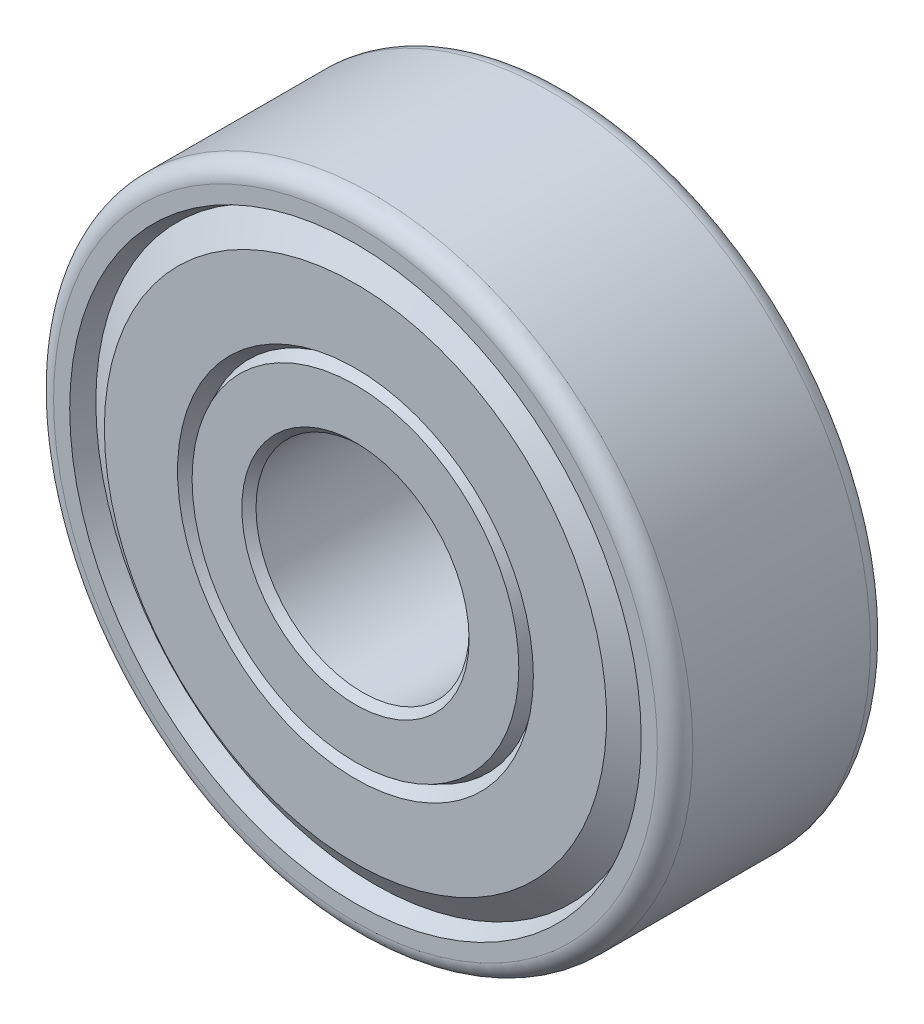
ISO-10303-21;
HEADER;
FILE_DESCRIPTION(('STEP AP214'),'2;1');
FILE_NAME('part.step','',(''),(''),'','','');
FILE_SCHEMA(('AUTOMOTIVE_DESIGN { 1 0 10303 214 1 1 1 1 }'));
ENDSEC;
DATA;
#1=APPLICATION_CONTEXT('core data for automotive mechanical design processes');
#2=APPLICATION_PROTOCOL_DEFINITION('international standard','automotive_design',2000,#1);
#3=PRODUCT_CONTEXT('',#1,'mechanical');
#4=PRODUCT('Part','Part','',(#3));
#5=PRODUCT_RELATED_PRODUCT_CATEGORY('part','',(#4));
#6=PRODUCT_DEFINITION_FORMATION('','',#4);
#7=PRODUCT_DEFINITION_CONTEXT('part definition',#1,'design');
#8=PRODUCT_DEFINITION('design','',#6,#7);
#9=PRODUCT_DEFINITION_SHAPE('','',#8);
#10=(LENGTH_UNIT() NAMED_UNIT(*) SI_UNIT(.MILLI.,.METRE.));
#11=(NAMED_UNIT(*) PLANE_ANGLE_UNIT() SI_UNIT($,.RADIAN.));
#12=(NAMED_UNIT(*) SI_UNIT($,.STERADIAN.) SOLID_ANGLE_UNIT());
#13=UNCERTAINTY_MEASURE_WITH_UNIT(LENGTH_MEASURE(1.E-05),#10,'distance_accuracy_value','');
#14=(GEOMETRIC_REPRESENTATION_CONTEXT(3) GLOBAL_UNCERTAINTY_ASSIGNED_CONTEXT((#13)) GLOBAL_UNIT_ASSIGNED_CONTEXT((#10,
#11,#12)) REPRESENTATION_CONTEXT('',''));
#15=CARTESIAN_POINT('',(0.,0.,0.));
#16=DIRECTION('',(0.,0.,1.));
#17=DIRECTION('',(1.,0.,0.));
#18=AXIS2_PLACEMENT_3D('',#15,#16,#17);
#19=CARTESIAN_POINT('',(0.,0.,0.));
#20=DIRECTION('',(0.,0.,1.));
#21=DIRECTION('',(1.,0.,0.));
#22=AXIS2_PLACEMENT_3D('',#19,#20,#21);
#23=CYLINDRICAL_SURFACE('',#22,4.7625);
#24=CARTESIAN_POINT('',(0.,0.,-4.44499999986192));
#25=DIRECTION('',(0.,0.,-1.));
#26=DIRECTION('',(-1.,0.,0.));
#27=AXIS2_PLACEMENT_3D('',#24,#25,#26);
#28=CIRCLE('',#27,4.76250000008349);
#29=CARTESIAN_POINT('',(-4.76250000008349,0.,-4.44499999986192));
#30=VERTEX_POINT('',#29);
#31=EDGE_CURVE('E315',#30,#30,#28,.T.);
#32=ORIENTED_EDGE('',*,*,#31,.T.);
#33=EDGE_LOOP('',(#32));
#34=FACE_BOUND('',#33,.T.);
#35=CARTESIAN_POINT('',(0.,0.,4.44499999986192));
#36=DIRECTION('',(0.,0.,1.));
#37=DIRECTION('',(-1.,0.,0.));
#38=AXIS2_PLACEMENT_3D('',#35,#36,#37);
#39=CIRCLE('',#38,4.76250000008349);
#40=CARTESIAN_POINT('',(-4.76250000008349,0.,4.44499999986192));
#41=VERTEX_POINT('',#40);
#42=EDGE_CURVE('E318',#41,#41,#39,.T.);
#43=ORIENTED_EDGE('',*,*,#42,.T.);
#44=EDGE_LOOP('',(#43));
#45=FACE_BOUND('',#44,.T.);
#46=ADVANCED_FACE('F17',(#34,#45),#23,.F.);
#47=CARTESIAN_POINT('',(0.,0.,-4.7624999999698));
#48=DIRECTION('',(0.,0.,-1.));
#49=DIRECTION('',(-1.,0.,0.));
#50=AXIS2_PLACEMENT_3D('',#47,#48,#49);
#51=CONICAL_SURFACE('',#50,5.07999999962294,0.785398162502276);
#52=CARTESIAN_POINT('',(0.,0.,-4.76250000008349));
#53=DIRECTION('',(0.,0.,-1.));
#54=DIRECTION('',(-1.,0.,0.));
#55=AXIS2_PLACEMENT_3D('',#52,#53,#54);
#56=CIRCLE('',#55,5.07999999973663);
#57=CARTESIAN_POINT('',(-5.07999999973663,0.,-4.76250000008349));
#58=VERTEX_POINT('',#57);
#59=EDGE_CURVE('E319',#58,#58,#56,.F.);
#60=ORIENTED_EDGE('',*,*,#59,.F.);
#61=EDGE_LOOP('',(#60));
#62=FACE_BOUND('',#61,.T.);
#63=ORIENTED_EDGE('',*,*,#31,.F.);
#64=EDGE_LOOP('',(#63));
#65=FACE_BOUND('',#64,.T.);
#66=ADVANCED_FACE('F249',(#62,#65),#51,.F.);
#67=CARTESIAN_POINT('',(0.,0.,4.7624999999698));
#68=DIRECTION('',(0.,0.,1.));
#69=DIRECTION('',(1.,0.,0.));
#70=AXIS2_PLACEMENT_3D('',#67,#68,#69);
#71=CONICAL_SURFACE('',#70,5.07999999962294,0.785398162502276);
#72=ORIENTED_EDGE('',*,*,#42,.F.);
#73=EDGE_LOOP('',(#72));
#74=FACE_BOUND('',#73,.T.);
#75=CARTESIAN_POINT('',(0.,0.,4.76250000008349));
#76=DIRECTION('',(0.,0.,1.));
#77=DIRECTION('',(1.,0.,0.));
#78=AXIS2_PLACEMENT_3D('',#75,#76,#77);
#79=CIRCLE('',#78,5.07999999973663);
#80=CARTESIAN_POINT('',(5.07999999973663,0.,4.76250000008349));
#81=VERTEX_POINT('',#80);
#82=EDGE_CURVE('E322',#81,#81,#79,.T.);
#83=ORIENTED_EDGE('',*,*,#82,.T.);
#84=EDGE_LOOP('',(#83));
#85=FACE_BOUND('',#84,.T.);
#86=ADVANCED_FACE('F241',(#74,#85),#71,.F.);
#87=CARTESIAN_POINT('',(0.,0.,-4.7625));
#88=DIRECTION('',(0.,0.,-1.));
#89=DIRECTION('',(-1.,0.,0.));
#90=AXIS2_PLACEMENT_3D('',#87,#88,#89);
#91=PLANE('',#90);
#92=ORIENTED_EDGE('',*,*,#59,.T.);
#93=EDGE_LOOP('',(#92));
#94=FACE_BOUND('',#93,.T.);
#95=CARTESIAN_POINT('',(0.,0.,-4.7625));
#96=DIRECTION('',(0.,0.,1.));
#97=DIRECTION('',(1.,0.,0.));
#98=AXIS2_PLACEMENT_3D('',#95,#96,#97);
#99=CIRCLE('',#98,7.3025);
#100=CARTESIAN_POINT('',(7.3025,0.,-4.7625));
#101=VERTEX_POINT('',#100);
#102=EDGE_CURVE('E352',#101,#101,#99,.T.);
#103=ORIENTED_EDGE('',*,*,#102,.F.);
#104=EDGE_LOOP('',(#103));
#105=FACE_BOUND('',#104,.T.);
#106=ADVANCED_FACE('F233',(#94,#105),#91,.T.);
#107=CARTESIAN_POINT('',(0.,0.,4.7625));
#108=DIRECTION('',(0.,0.,-1.));
#109=DIRECTION('',(-1.,0.,0.));
#110=AXIS2_PLACEMENT_3D('',#107,#108,#109);
#111=PLANE('',#110);
#112=ORIENTED_EDGE('',*,*,#82,.F.);
#113=EDGE_LOOP('',(#112));
#114=FACE_BOUND('',#113,.T.);
#115=CARTESIAN_POINT('',(0.,0.,4.76250000005854));
#116=DIRECTION('',(0.,0.,-1.));
#117=DIRECTION('',(-1.,0.,0.));
#118=AXIS2_PLACEMENT_3D('',#115,#116,#117);
#119=CIRCLE('',#118,7.30250000013546);
#120=CARTESIAN_POINT('',(-7.30250000013546,0.,4.76250000005854));
#121=VERTEX_POINT('',#120);
#122=EDGE_CURVE('E349',#121,#121,#119,.T.);
#123=ORIENTED_EDGE('',*,*,#122,.F.);
#124=EDGE_LOOP('',(#123));
#125=FACE_BOUND('',#124,.T.);
#126=ADVANCED_FACE('F225',(#114,#125),#111,.F.);
#127=CARTESIAN_POINT('',(0.,0.,-4.18132890087755));
#128=DIRECTION('',(0.,0.,1.));
#129=DIRECTION('',(1.,0.,0.));
#130=AXIS2_PLACEMENT_3D('',#127,#128,#129);
#131=CONICAL_SURFACE('',#130,7.55365742462336,0.407917424824535);
#132=CARTESIAN_POINT('',(0.,0.,-4.18132890087755));
#133=DIRECTION('',(0.,0.,-1.));
#134=DIRECTION('',(-1.,0.,0.));
#135=AXIS2_PLACEMENT_3D('',#132,#133,#134);
#136=CIRCLE('',#135,7.55365742462337);
#137=CARTESIAN_POINT('',(-7.55365742462337,0.,-4.18132890087755));
#138=VERTEX_POINT('',#137);
#139=EDGE_CURVE('E326',#138,#138,#136,.T.);
#140=ORIENTED_EDGE('',*,*,#139,.T.);
#141=EDGE_LOOP('',(#140));
#142=FACE_BOUND('',#141,.T.);
#143=ORIENTED_EDGE('',*,*,#102,.T.);
#144=EDGE_LOOP('',(#143));
#145=FACE_BOUND('',#144,.T.);
#146=ADVANCED_FACE('F217',(#142,#145),#131,.T.);
#147=CARTESIAN_POINT('',(0.,0.,4.18132890087755));
#148=DIRECTION('',(0.,0.,-1.));
#149=DIRECTION('',(-1.,0.,0.));
#150=AXIS2_PLACEMENT_3D('',#147,#148,#149);
#151=CONICAL_SURFACE('',#150,7.55365742446263,0.407917424358415);
#152=CARTESIAN_POINT('',(0.,0.,4.18132890066575));
#153=DIRECTION('',(0.,0.,1.));
#154=DIRECTION('',(-1.,0.,0.));
#155=AXIS2_PLACEMENT_3D('',#152,#153,#154);
#156=CIRCLE('',#155,7.55365742477154);
#157=CARTESIAN_POINT('',(-7.55365742477154,0.,4.18132890066575));
#158=VERTEX_POINT('',#157);
#159=EDGE_CURVE('E348',#158,#158,#156,.T.);
#160=ORIENTED_EDGE('',*,*,#159,.T.);
#161=EDGE_LOOP('',(#160));
#162=FACE_BOUND('',#161,.T.);
#163=ORIENTED_EDGE('',*,*,#122,.T.);
#164=EDGE_LOOP('',(#163));
#165=FACE_BOUND('',#164,.T.);
#166=ADVANCED_FACE('F209',(#162,#165),#151,.T.);
#167=CARTESIAN_POINT('',(0.,0.,-4.7625));
#168=DIRECTION('',(0.,0.,-1.));
#169=DIRECTION('',(-1.,0.,0.));
#170=AXIS2_PLACEMENT_3D('',#167,#168,#169);
#171=CONICAL_SURFACE('',#170,7.952136972928,0.601029540804804);
#172=ORIENTED_EDGE('',*,*,#139,.F.);
#173=EDGE_LOOP('',(#172));
#174=FACE_BOUND('',#173,.T.);
#175=CARTESIAN_POINT('',(0.,0.,-4.7625));
#176=DIRECTION('',(0.,0.,-1.));
#177=DIRECTION('',(-1.,0.,0.));
#178=AXIS2_PLACEMENT_3D('',#175,#176,#177);
#179=CIRCLE('',#178,7.952136972928);
#180=CARTESIAN_POINT('',(-7.952136972928,0.,-4.7625));
#181=VERTEX_POINT('',#180);
#182=EDGE_CURVE('E345',#181,#181,#179,.F.);
#183=ORIENTED_EDGE('',*,*,#182,.F.);
#184=EDGE_LOOP('',(#183));
#185=FACE_BOUND('',#184,.T.);
#186=ADVANCED_FACE('F201',(#174,#185),#171,.F.);
#187=CARTESIAN_POINT('',(0.,0.,4.7625));
#188=DIRECTION('',(0.,0.,1.));
#189=DIRECTION('',(1.,0.,0.));
#190=AXIS2_PLACEMENT_3D('',#187,#188,#189);
#191=CONICAL_SURFACE('',#190,7.95213697263462,0.601029540118035);
#192=CARTESIAN_POINT('',(0.,0.,4.7625));
#193=DIRECTION('',(0.,0.,1.));
#194=DIRECTION('',(1.,0.,0.));
#195=AXIS2_PLACEMENT_3D('',#192,#193,#194);
#196=CIRCLE('',#195,7.95213697263462);
#197=CARTESIAN_POINT('',(7.95213697263462,0.,4.7625));
#198=VERTEX_POINT('',#197);
#199=EDGE_CURVE('E342',#198,#198,#196,.T.);
#200=ORIENTED_EDGE('',*,*,#199,.T.);
#201=EDGE_LOOP('',(#200));
#202=FACE_BOUND('',#201,.T.);
#203=ORIENTED_EDGE('',*,*,#159,.F.);
#204=EDGE_LOOP('',(#203));
#205=FACE_BOUND('',#204,.T.);
#206=ADVANCED_FACE('F193',(#202,#205),#191,.F.);
#207=CARTESIAN_POINT('',(0.,0.,-4.7625));
#208=DIRECTION('',(0.,0.,-1.));
#209=DIRECTION('',(-1.,0.,0.));
#210=AXIS2_PLACEMENT_3D('',#207,#208,#209);
#211=PLANE('',#210);
#212=ORIENTED_EDGE('',*,*,#182,.T.);
#213=EDGE_LOOP('',(#212));
#214=FACE_BOUND('',#213,.T.);
#215=CARTESIAN_POINT('',(0.,0.,-4.7625));
#216=DIRECTION('',(0.,0.,1.));
#217=DIRECTION('',(1.,0.,0.));
#218=AXIS2_PLACEMENT_3D('',#215,#216,#217);
#219=CIRCLE('',#218,11.2241326943492);
#220=CARTESIAN_POINT('',(11.2241326943492,0.,-4.7625));
#221=VERTEX_POINT('',#220);
#222=EDGE_CURVE('E339',#221,#221,#219,.T.);
#223=ORIENTED_EDGE('',*,*,#222,.F.);
#224=EDGE_LOOP('',(#223));
#225=FACE_BOUND('',#224,.T.);
#226=ADVANCED_FACE('F185',(#214,#225),#211,.T.);
#227=CARTESIAN_POINT('',(0.,0.,4.7625));
#228=DIRECTION('',(0.,0.,-1.));
#229=DIRECTION('',(-1.,0.,0.));
#230=AXIS2_PLACEMENT_3D('',#227,#228,#229);
#231=PLANE('',#230);
#232=ORIENTED_EDGE('',*,*,#199,.F.);
#233=EDGE_LOOP('',(#232));
#234=FACE_BOUND('',#233,.T.);
#235=CARTESIAN_POINT('',(0.,0.,4.76250000067259));
#236=DIRECTION('',(0.,0.,-1.));
#237=DIRECTION('',(-1.,0.,0.));
#238=AXIS2_PLACEMENT_3D('',#235,#236,#237);
#239=CIRCLE('',#238,11.2241326948103);
#240=CARTESIAN_POINT('',(-11.2241326948103,0.,4.76250000067259));
#241=VERTEX_POINT('',#240);
#242=EDGE_CURVE('E335',#241,#241,#239,.T.);
#243=ORIENTED_EDGE('',*,*,#242,.F.);
#244=EDGE_LOOP('',(#243));
#245=FACE_BOUND('',#244,.T.);
#246=ADVANCED_FACE('F177',(#234,#245),#231,.F.);
#247=CARTESIAN_POINT('',(0.,0.,-3.93017144225871));
#248=DIRECTION('',(0.,0.,1.));
#249=DIRECTION('',(1.,0.,0.));
#250=AXIS2_PLACEMENT_3D('',#247,#248,#249);
#251=CONICAL_SURFACE('',#250,12.4380602466955,0.969766785990084);
#252=CARTESIAN_POINT('',(0.,0.,-3.93017144225872));
#253=DIRECTION('',(0.,0.,-1.));
#254=DIRECTION('',(-1.,0.,0.));
#255=AXIS2_PLACEMENT_3D('',#252,#253,#254);
#256=CIRCLE('',#255,12.4380602466955);
#257=CARTESIAN_POINT('',(-12.4380602466955,0.,-3.93017144225872));
#258=VERTEX_POINT('',#257);
#259=EDGE_CURVE('E338',#258,#258,#256,.T.);
#260=ORIENTED_EDGE('',*,*,#259,.T.);
#261=EDGE_LOOP('',(#260));
#262=FACE_BOUND('',#261,.T.);
#263=ORIENTED_EDGE('',*,*,#222,.T.);
#264=EDGE_LOOP('',(#263));
#265=FACE_BOUND('',#264,.T.);
#266=ADVANCED_FACE('F169',(#262,#265),#251,.T.);
#267=CARTESIAN_POINT('',(0.,0.,3.93017144225871));
#268=DIRECTION('',(0.,0.,-1.));
#269=DIRECTION('',(-1.,0.,0.));
#270=AXIS2_PLACEMENT_3D('',#267,#268,#269);
#271=CONICAL_SURFACE('',#270,12.4380602452534,0.969766784881962);
#272=CARTESIAN_POINT('',(0.,0.,3.93017144168615));
#273=DIRECTION('',(0.,0.,1.));
#274=DIRECTION('',(-1.,0.,0.));
#275=AXIS2_PLACEMENT_3D('',#272,#273,#274);
#276=CIRCLE('',#275,12.4380602466765);
#277=CARTESIAN_POINT('',(-12.4380602466765,0.,3.93017144168615));
#278=VERTEX_POINT('',#277);
#279=EDGE_CURVE('E334',#278,#278,#276,.T.);
#280=ORIENTED_EDGE('',*,*,#279,.T.);
#281=EDGE_LOOP('',(#280));
#282=FACE_BOUND('',#281,.T.);
#283=ORIENTED_EDGE('',*,*,#242,.T.);
#284=EDGE_LOOP('',(#283));
#285=FACE_BOUND('',#284,.T.);
#286=ADVANCED_FACE('F161',(#282,#285),#271,.T.);
#287=CARTESIAN_POINT('',(0.,0.,-4.7625));
#288=DIRECTION('',(0.,0.,-1.));
#289=DIRECTION('',(-1.,0.,0.));
#290=AXIS2_PLACEMENT_3D('',#287,#288,#289);
#291=CONICAL_SURFACE('',#290,12.7729368128599,0.382519398268516);
#292=ORIENTED_EDGE('',*,*,#259,.F.);
#293=EDGE_LOOP('',(#292));
#294=FACE_BOUND('',#293,.T.);
#295=CARTESIAN_POINT('',(0.,0.,-4.7625));
#296=DIRECTION('',(0.,0.,-1.));
#297=DIRECTION('',(-1.,0.,0.));
#298=AXIS2_PLACEMENT_3D('',#295,#296,#297);
#299=CIRCLE('',#298,12.7729368128599);
#300=CARTESIAN_POINT('',(-12.7729368128599,0.,-4.7625));
#301=VERTEX_POINT('',#300);
#302=EDGE_CURVE('E331',#301,#301,#299,.F.);
#303=ORIENTED_EDGE('',*,*,#302,.F.);
#304=EDGE_LOOP('',(#303));
#305=FACE_BOUND('',#304,.T.);
#306=ADVANCED_FACE('F153',(#294,#305),#291,.F.);
#307=CARTESIAN_POINT('',(0.,0.,4.7625));
#308=DIRECTION('',(0.,0.,1.));
#309=DIRECTION('',(1.,0.,0.));
#310=AXIS2_PLACEMENT_3D('',#307,#308,#309);
#311=CONICAL_SURFACE('',#310,12.7729368126486,0.382519397831445);
#312=CARTESIAN_POINT('',(0.,0.,4.7625));
#313=DIRECTION('',(0.,0.,1.));
#314=DIRECTION('',(1.,0.,0.));
#315=AXIS2_PLACEMENT_3D('',#312,#313,#314);
#316=CIRCLE('',#315,12.7729368126486);
#317=CARTESIAN_POINT('',(12.7729368126486,0.,4.7625));
#318=VERTEX_POINT('',#317);
#319=EDGE_CURVE('E52',#318,#318,#316,.T.);
#320=ORIENTED_EDGE('',*,*,#319,.T.);
#321=EDGE_LOOP('',(#320));
#322=FACE_BOUND('',#321,.T.);
#323=ORIENTED_EDGE('',*,*,#279,.F.);
#324=EDGE_LOOP('',(#323));
#325=FACE_BOUND('',#324,.T.);
#326=ADVANCED_FACE('F146',(#322,#325),#311,.F.);
#327=CARTESIAN_POINT('',(0.,0.,-4.7625));
#328=DIRECTION('',(0.,0.,-1.));
#329=DIRECTION('',(-1.,0.,0.));
#330=AXIS2_PLACEMENT_3D('',#327,#328,#329);
#331=PLANE('',#330);
#332=ORIENTED_EDGE('',*,*,#302,.T.);
#333=EDGE_LOOP('',(#332));
#334=FACE_BOUND('',#333,.T.);
#335=CARTESIAN_POINT('',(0.,0.,-4.76249999999999));
#336=DIRECTION('',(0.,0.,1.));
#337=DIRECTION('',(1.,0.,0.));
#338=AXIS2_PLACEMENT_3D('',#335,#336,#337);
#339=CIRCLE('',#338,13.49375);
#340=CARTESIAN_POINT('',(13.49375,0.,-4.7625));
#341=VERTEX_POINT('',#340);
#342=CARTESIAN_POINT('',(-13.49375,0.,-4.7625));
#343=VERTEX_POINT('',#342);
#344=EDGE_CURVE('E45',#341,#343,#339,.T.);
#345=ORIENTED_EDGE('',*,*,#344,.F.);
#346=CARTESIAN_POINT('',(0.,0.,-4.76249999999999));
#347=DIRECTION('',(0.,0.,1.));
#348=DIRECTION('',(-1.,0.,0.));
#349=AXIS2_PLACEMENT_3D('',#346,#347,#348);
#350=CIRCLE('',#349,13.49375);
#351=EDGE_CURVE('E50',#343,#341,#350,.T.);
#352=ORIENTED_EDGE('',*,*,#351,.F.);
#353=EDGE_LOOP('',(#345,#352));
#354=FACE_BOUND('',#353,.T.);
#355=ADVANCED_FACE('F49',(#334,#354),#331,.T.);
#356=CARTESIAN_POINT('',(0.,0.,4.7625));
#357=DIRECTION('',(0.,0.,-1.));
#358=DIRECTION('',(-1.,0.,0.));
#359=AXIS2_PLACEMENT_3D('',#356,#357,#358);
#360=PLANE('',#359);
#361=ORIENTED_EDGE('',*,*,#319,.F.);
#362=EDGE_LOOP('',(#361));
#363=FACE_BOUND('',#362,.T.);
#364=CARTESIAN_POINT('',(0.,0.,4.76250000000002));
#365=DIRECTION('',(0.,0.,-1.));
#366=DIRECTION('',(1.,0.,0.));
#367=AXIS2_PLACEMENT_3D('',#364,#365,#366);
#368=CIRCLE('',#367,13.49375);
#369=CARTESIAN_POINT('',(13.49375,0.,4.76250000000001));
#370=VERTEX_POINT('',#369);
#371=CARTESIAN_POINT('',(-13.49375,0.,4.76250000000001));
#372=VERTEX_POINT('',#371);
#373=EDGE_CURVE('E57',#370,#372,#368,.T.);
#374=ORIENTED_EDGE('',*,*,#373,.F.);
#375=CARTESIAN_POINT('',(0.,0.,4.76250000000002));
#376=DIRECTION('',(0.,0.,-1.));
#377=DIRECTION('',(-1.,0.,0.));
#378=AXIS2_PLACEMENT_3D('',#375,#376,#377);
#379=CIRCLE('',#378,13.49375);
#380=EDGE_CURVE('E36',#372,#370,#379,.T.);
#381=ORIENTED_EDGE('',*,*,#380,.F.);
#382=EDGE_LOOP('',(#374,#381));
#383=FACE_BOUND('',#382,.T.);
#384=ADVANCED_FACE('F78',(#363,#383),#360,.F.);
#385=CARTESIAN_POINT('',(0.,0.,-3.96874999999999));
#386=DIRECTION('',(0.,0.,1.));
#387=DIRECTION('',(1.,0.,0.));
#388=AXIS2_PLACEMENT_3D('',#385,#386,#387);
#389=TOROIDAL_SURFACE('',#388,13.49375,0.79375);
#390=ORIENTED_EDGE('',*,*,#344,.T.);
#391=ORIENTED_EDGE('',*,*,#351,.T.);
#392=EDGE_LOOP('',(#390,#391));
#393=FACE_BOUND('',#392,.T.);
#394=CARTESIAN_POINT('',(0.,0.,-3.96874999999999));
#395=DIRECTION('',(0.,0.,1.));
#396=DIRECTION('',(1.,0.,0.));
#397=AXIS2_PLACEMENT_3D('',#394,#395,#396);
#398=CIRCLE('',#397,14.2875);
#399=CARTESIAN_POINT('',(14.2875,0.,-3.96874999999999));
#400=VERTEX_POINT('',#399);
#401=EDGE_CURVE('E28',#400,#400,#398,.T.);
#402=ORIENTED_EDGE('',*,*,#401,.F.);
#403=EDGE_LOOP('',(#402));
#404=FACE_BOUND('',#403,.T.);
#405=ADVANCED_FACE('F55',(#393,#404),#389,.T.);
#406=CARTESIAN_POINT('',(0.,0.,3.96875000000002));
#407=DIRECTION('',(0.,0.,-1.));
#408=DIRECTION('',(-1.,0.,0.));
#409=AXIS2_PLACEMENT_3D('',#406,#407,#408);
#410=TOROIDAL_SURFACE('',#409,13.49375,0.79375);
#411=ORIENTED_EDGE('',*,*,#380,.T.);
#412=ORIENTED_EDGE('',*,*,#373,.T.);
#413=EDGE_LOOP('',(#411,#412));
#414=FACE_BOUND('',#413,.T.);
#415=CARTESIAN_POINT('',(0.,0.,3.96875000000002));
#416=DIRECTION('',(0.,0.,1.));
#417=DIRECTION('',(1.,0.,0.));
#418=AXIS2_PLACEMENT_3D('',#415,#416,#417);
#419=CIRCLE('',#418,14.2875);
#420=CARTESIAN_POINT('',(14.2875,0.,3.96875000000002));
#421=VERTEX_POINT('',#420);
#422=EDGE_CURVE('E11',#421,#421,#419,.F.);
#423=ORIENTED_EDGE('',*,*,#422,.F.);
#424=EDGE_LOOP('',(#423));
#425=FACE_BOUND('',#424,.T.);
#426=ADVANCED_FACE('F77',(#414,#425),#410,.T.);
#427=CARTESIAN_POINT('',(0.,0.,0.));
#428=DIRECTION('',(0.,0.,1.));
#429=DIRECTION('',(1.,0.,0.));
#430=AXIS2_PLACEMENT_3D('',#427,#428,#429);
#431=CYLINDRICAL_SURFACE('',#430,14.2875);
#432=ORIENTED_EDGE('',*,*,#422,.T.);
#433=EDGE_LOOP('',(#432));
#434=FACE_BOUND('',#433,.T.);
#435=ORIENTED_EDGE('',*,*,#401,.T.);
#436=EDGE_LOOP('',(#435));
#437=FACE_BOUND('',#436,.T.);
#438=ADVANCED_FACE('F118',(#434,#437),#431,.T.);
#439=CLOSED_SHELL('',(#46,#66,#86,#106,#126,#146,#166,#186,#206,#226,#246,#266,#286,#306,#326,
#355,#384,#405,#426,#438));
#440=MANIFOLD_SOLID_BREP('B1',#439);
#441=ADVANCED_BREP_SHAPE_REPRESENTATION('',(#18,#440),#14);
#442=SHAPE_DEFINITION_REPRESENTATION(#9,#441);
ENDSEC;
END-ISO-10303-21;
